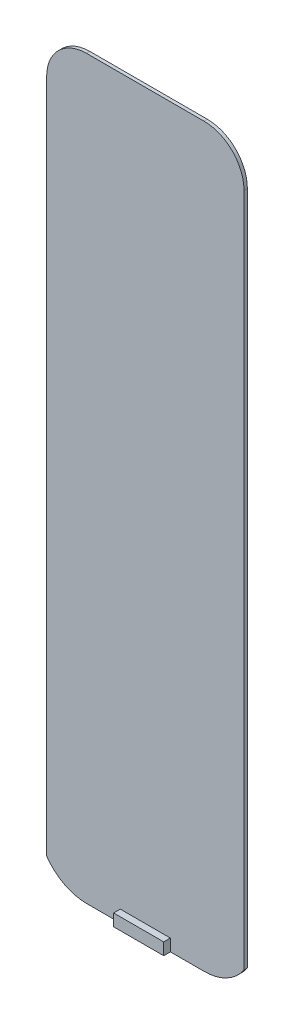
ISO-10303-21;
HEADER;
FILE_DESCRIPTION(('STEP AP214'),'2;1');
FILE_NAME('part.step','',(''),(''),'','','');
FILE_SCHEMA(('AUTOMOTIVE_DESIGN { 1 0 10303 214 1 1 1 1 }'));
ENDSEC;
DATA;
#1=APPLICATION_CONTEXT('core data for automotive mechanical design processes');
#2=APPLICATION_PROTOCOL_DEFINITION('international standard','automotive_design',2000,#1);
#3=PRODUCT_CONTEXT('',#1,'mechanical');
#4=PRODUCT('Part','Part','',(#3));
#5=PRODUCT_RELATED_PRODUCT_CATEGORY('part','',(#4));
#6=PRODUCT_DEFINITION_FORMATION('','',#4);
#7=PRODUCT_DEFINITION_CONTEXT('part definition',#1,'design');
#8=PRODUCT_DEFINITION('design','',#6,#7);
#9=PRODUCT_DEFINITION_SHAPE('','',#8);
#10=(LENGTH_UNIT() NAMED_UNIT(*) SI_UNIT(.MILLI.,.METRE.));
#11=(NAMED_UNIT(*) PLANE_ANGLE_UNIT() SI_UNIT($,.RADIAN.));
#12=(NAMED_UNIT(*) SI_UNIT($,.STERADIAN.) SOLID_ANGLE_UNIT());
#13=UNCERTAINTY_MEASURE_WITH_UNIT(LENGTH_MEASURE(1.E-05),#10,'distance_accuracy_value','');
#14=(GEOMETRIC_REPRESENTATION_CONTEXT(3) GLOBAL_UNCERTAINTY_ASSIGNED_CONTEXT((#13)) GLOBAL_UNIT_ASSIGNED_CONTEXT((#10,
#11,#12)) REPRESENTATION_CONTEXT('',''));
#15=CARTESIAN_POINT('',(0.,0.,0.));
#16=DIRECTION('',(0.,0.,1.));
#17=DIRECTION('',(1.,0.,0.));
#18=AXIS2_PLACEMENT_3D('',#15,#16,#17);
#19=CARTESIAN_POINT('',(-17.5243575181583,-95.5,0.5));
#20=DIRECTION('',(0.,0.,-1.));
#21=DIRECTION('',(-1.,0.,0.));
#22=AXIS2_PLACEMENT_3D('',#19,#20,#21);
#23=PLANE('',#22);
#24=DIRECTION('',(0.,-1.,0.));
#25=VECTOR('',#24,1.);
#26=CARTESIAN_POINT('',(-7.49999999999996,-106.5,0.5));
#27=LINE('',#26,#25);
#28=CARTESIAN_POINT('',(-7.49999999999996,-106.5,0.5));
#29=VERTEX_POINT('',#28);
#30=CARTESIAN_POINT('',(-7.49999999999996,-110.1,0.5));
#31=VERTEX_POINT('',#30);
#32=EDGE_CURVE('E202',#29,#31,#27,.T.);
#33=ORIENTED_EDGE('',*,*,#32,.F.);
#34=DIRECTION('',(1.,0.,0.));
#35=VECTOR('',#34,1.);
#36=CARTESIAN_POINT('',(-7.49999999999996,-106.5,0.5));
#37=LINE('',#36,#35);
#38=CARTESIAN_POINT('',(7.50000000000004,-106.5,0.5));
#39=VERTEX_POINT('',#38);
#40=EDGE_CURVE('E189',#29,#39,#37,.T.);
#41=ORIENTED_EDGE('',*,*,#40,.T.);
#42=DIRECTION('',(0.,-1.,0.));
#43=VECTOR('',#42,1.);
#44=CARTESIAN_POINT('',(7.50000000000004,-106.5,0.5));
#45=LINE('',#44,#43);
#46=CARTESIAN_POINT('',(7.50000000000004,-110.1,0.5));
#47=VERTEX_POINT('',#46);
#48=EDGE_CURVE('E199',#39,#47,#45,.T.);
#49=ORIENTED_EDGE('',*,*,#48,.T.);
#50=DIRECTION('',(1.,0.,0.));
#51=VECTOR('',#50,1.);
#52=CARTESIAN_POINT('',(17.6756424818417,-110.1,0.5));
#53=LINE('',#52,#51);
#54=CARTESIAN_POINT('',(17.6756424818417,-110.1,0.5));
#55=VERTEX_POINT('',#54);
#56=EDGE_CURVE('E210',#47,#55,#53,.T.);
#57=ORIENTED_EDGE('',*,*,#56,.T.);
#58=CARTESIAN_POINT('',(17.6756424818417,-95.7855956890526,0.5));
#59=DIRECTION('',(0.,0.,1.));
#60=DIRECTION('',(-1.,0.,0.));
#61=AXIS2_PLACEMENT_3D('',#58,#59,#60);
#62=CIRCLE('',#61,14.3144043109474);
#63=CARTESIAN_POINT('',(29.56,-103.764581662086,0.5));
#64=VERTEX_POINT('',#63);
#65=EDGE_CURVE('E215',#55,#64,#62,.T.);
#66=ORIENTED_EDGE('',*,*,#65,.T.);
#67=DIRECTION('',(0.,1.,0.));
#68=VECTOR('',#67,1.);
#69=CARTESIAN_POINT('',(29.56,98.5,0.5));
#70=LINE('',#69,#68);
#71=CARTESIAN_POINT('',(29.56,98.5,0.5));
#72=VERTEX_POINT('',#71);
#73=EDGE_CURVE('E217',#64,#72,#70,.T.);
#74=ORIENTED_EDGE('',*,*,#73,.T.);
#75=CARTESIAN_POINT('',(17.6,98.5,0.5));
#76=DIRECTION('',(0.,0.,1.));
#77=DIRECTION('',(-1.,0.,0.));
#78=AXIS2_PLACEMENT_3D('',#75,#76,#77);
#79=CIRCLE('',#78,11.96);
#80=CARTESIAN_POINT('',(17.6,110.46,0.5));
#81=VERTEX_POINT('',#80);
#82=EDGE_CURVE('E219',#72,#81,#79,.T.);
#83=ORIENTED_EDGE('',*,*,#82,.T.);
#84=DIRECTION('',(-1.,0.,0.));
#85=VECTOR('',#84,1.);
#86=CARTESIAN_POINT('',(-17.6,110.46,0.5));
#87=LINE('',#86,#85);
#88=CARTESIAN_POINT('',(-17.6,110.46,0.5));
#89=VERTEX_POINT('',#88);
#90=EDGE_CURVE('E221',#81,#89,#87,.T.);
#91=ORIENTED_EDGE('',*,*,#90,.T.);
#92=CARTESIAN_POINT('',(-17.6,98.5,0.5));
#93=DIRECTION('',(0.,0.,1.));
#94=DIRECTION('',(1.,0.,0.));
#95=AXIS2_PLACEMENT_3D('',#92,#93,#94);
#96=CIRCLE('',#95,11.9599999999999);
#97=CARTESIAN_POINT('',(-29.56,98.5,0.5));
#98=VERTEX_POINT('',#97);
#99=EDGE_CURVE('E223',#89,#98,#96,.T.);
#100=ORIENTED_EDGE('',*,*,#99,.T.);
#101=DIRECTION('',(0.,-1.,0.));
#102=VECTOR('',#101,1.);
#103=CARTESIAN_POINT('',(-29.5599999999999,98.5,0.5));
#104=LINE('',#103,#102);
#105=CARTESIAN_POINT('',(-29.5599999999999,-103.764581662086,0.5));
#106=VERTEX_POINT('',#105);
#107=EDGE_CURVE('E225',#98,#106,#104,.T.);
#108=ORIENTED_EDGE('',*,*,#107,.T.);
#109=CARTESIAN_POINT('',(-17.5243575181583,-95.5,0.5));
#110=DIRECTION('',(0.,0.,1.));
#111=DIRECTION('',(-1.,0.,0.));
#112=AXIS2_PLACEMENT_3D('',#109,#110,#111);
#113=CIRCLE('',#112,14.6);
#114=CARTESIAN_POINT('',(-17.5243575181583,-110.1,0.5));
#115=VERTEX_POINT('',#114);
#116=EDGE_CURVE('E207',#106,#115,#113,.T.);
#117=ORIENTED_EDGE('',*,*,#116,.T.);
#118=EDGE_CURVE('E212',#115,#31,#53,.T.);
#119=ORIENTED_EDGE('',*,*,#118,.T.);
#120=EDGE_LOOP('',(#33,#41,#49,#57,#66,#74,#83,#91,#100,#108,#117,#119));
#121=FACE_BOUND('',#120,.T.);
#122=ADVANCED_FACE('F33',(#121),#23,.F.);
#123=CARTESIAN_POINT('',(-17.5243575181583,-95.5,0.5));
#124=DIRECTION('',(0.,0.,-1.));
#125=DIRECTION('',(-1.,0.,0.));
#126=AXIS2_PLACEMENT_3D('',#123,#124,#125);
#127=CYLINDRICAL_SURFACE('',#126,14.6);
#128=CARTESIAN_POINT('',(-17.5243575181583,-95.5,-0.5));
#129=DIRECTION('',(0.,0.,1.));
#130=DIRECTION('',(-1.,0.,0.));
#131=AXIS2_PLACEMENT_3D('',#128,#129,#130);
#132=CIRCLE('',#131,14.6);
#133=CARTESIAN_POINT('',(-29.5599999999999,-103.764581662086,-0.5));
#134=VERTEX_POINT('',#133);
#135=CARTESIAN_POINT('',(-17.5243575181583,-110.1,-0.5));
#136=VERTEX_POINT('',#135);
#137=EDGE_CURVE('E201',#134,#136,#132,.T.);
#138=ORIENTED_EDGE('',*,*,#137,.T.);
#139=DIRECTION('',(0.,0.,-1.));
#140=VECTOR('',#139,1.);
#141=CARTESIAN_POINT('',(-17.5243575181583,-110.1,0.5));
#142=LINE('',#141,#140);
#143=EDGE_CURVE('E11',#115,#136,#142,.T.);
#144=ORIENTED_EDGE('',*,*,#143,.F.);
#145=ORIENTED_EDGE('',*,*,#116,.F.);
#146=DIRECTION('',(0.,0.,-1.));
#147=VECTOR('',#146,1.);
#148=CARTESIAN_POINT('',(-29.5599999999999,-103.764581662086,0.5));
#149=LINE('',#148,#147);
#150=EDGE_CURVE('E227',#106,#134,#149,.T.);
#151=ORIENTED_EDGE('',*,*,#150,.T.);
#152=EDGE_LOOP('',(#138,#144,#145,#151));
#153=FACE_BOUND('',#152,.T.);
#154=ADVANCED_FACE('F35',(#153),#127,.T.);
#155=CARTESIAN_POINT('',(17.6756424818417,-110.1,0.5));
#156=DIRECTION('',(0.,1.,0.));
#157=DIRECTION('',(-1.,0.,0.));
#158=AXIS2_PLACEMENT_3D('',#155,#156,#157);
#159=PLANE('',#158);
#160=DIRECTION('',(1.,0.,0.));
#161=VECTOR('',#160,1.);
#162=CARTESIAN_POINT('',(17.6756424818417,-110.1,-0.5));
#163=LINE('',#162,#161);
#164=CARTESIAN_POINT('',(-7.49999999999996,-110.1,-0.5));
#165=VERTEX_POINT('',#164);
#166=EDGE_CURVE('E231',#136,#165,#163,.T.);
#167=ORIENTED_EDGE('',*,*,#166,.T.);
#168=DIRECTION('',(0.,0.,-1.));
#169=VECTOR('',#168,1.);
#170=CARTESIAN_POINT('',(-7.49999999999996,-110.1,-2.5));
#171=LINE('',#170,#169);
#172=CARTESIAN_POINT('',(-7.49999999999996,-110.1,-2.5));
#173=VERTEX_POINT('',#172);
#174=EDGE_CURVE('E48',#165,#173,#171,.T.);
#175=ORIENTED_EDGE('',*,*,#174,.T.);
#176=DIRECTION('',(1.,0.,0.));
#177=VECTOR('',#176,1.);
#178=CARTESIAN_POINT('',(-7.49999999999996,-110.1,-2.5));
#179=LINE('',#178,#177);
#180=CARTESIAN_POINT('',(7.50000000000004,-110.1,-2.5));
#181=VERTEX_POINT('',#180);
#182=EDGE_CURVE('E151',#173,#181,#179,.T.);
#183=ORIENTED_EDGE('',*,*,#182,.T.);
#184=DIRECTION('',(0.,0.,1.));
#185=VECTOR('',#184,1.);
#186=CARTESIAN_POINT('',(7.50000000000004,-110.1,-2.5));
#187=LINE('',#186,#185);
#188=CARTESIAN_POINT('',(7.50000000000004,-110.1,-0.5));
#189=VERTEX_POINT('',#188);
#190=EDGE_CURVE('E167',#181,#189,#187,.T.);
#191=ORIENTED_EDGE('',*,*,#190,.T.);
#192=CARTESIAN_POINT('',(17.6756424818417,-110.1,-0.5));
#193=VERTEX_POINT('',#192);
#194=EDGE_CURVE('E230',#189,#193,#163,.T.);
#195=ORIENTED_EDGE('',*,*,#194,.T.);
#196=DIRECTION('',(0.,0.,-1.));
#197=VECTOR('',#196,1.);
#198=CARTESIAN_POINT('',(17.6756424818417,-110.1,0.5));
#199=LINE('',#198,#197);
#200=EDGE_CURVE('E41',#55,#193,#199,.T.);
#201=ORIENTED_EDGE('',*,*,#200,.F.);
#202=ORIENTED_EDGE('',*,*,#56,.F.);
#203=DIRECTION('',(0.,0.,1.));
#204=VECTOR('',#203,1.);
#205=CARTESIAN_POINT('',(7.50000000000004,-110.1,0.5));
#206=LINE('',#205,#204);
#207=CARTESIAN_POINT('',(7.50000000000004,-110.1,2.5));
#208=VERTEX_POINT('',#207);
#209=EDGE_CURVE('E56',#47,#208,#206,.T.);
#210=ORIENTED_EDGE('',*,*,#209,.T.);
#211=DIRECTION('',(-1.,0.,0.));
#212=VECTOR('',#211,1.);
#213=CARTESIAN_POINT('',(-7.49999999999996,-110.1,2.5));
#214=LINE('',#213,#212);
#215=CARTESIAN_POINT('',(-7.49999999999996,-110.1,2.5));
#216=VERTEX_POINT('',#215);
#217=EDGE_CURVE('E194',#208,#216,#214,.T.);
#218=ORIENTED_EDGE('',*,*,#217,.T.);
#219=DIRECTION('',(0.,0.,-1.));
#220=VECTOR('',#219,1.);
#221=CARTESIAN_POINT('',(-7.49999999999996,-110.1,0.5));
#222=LINE('',#221,#220);
#223=EDGE_CURVE('E184',#216,#31,#222,.T.);
#224=ORIENTED_EDGE('',*,*,#223,.T.);
#225=ORIENTED_EDGE('',*,*,#118,.F.);
#226=ORIENTED_EDGE('',*,*,#143,.T.);
#227=EDGE_LOOP('',(#167,#175,#183,#191,#195,#201,#202,#210,#218,#224,#225,#226));
#228=FACE_BOUND('',#227,.T.);
#229=ADVANCED_FACE('F289',(#228),#159,.F.);
#230=CARTESIAN_POINT('',(17.6756424818417,-95.7855956890526,0.5));
#231=DIRECTION('',(0.,0.,-1.));
#232=DIRECTION('',(-1.,0.,0.));
#233=AXIS2_PLACEMENT_3D('',#230,#231,#232);
#234=CYLINDRICAL_SURFACE('',#233,14.3144043109474);
#235=CARTESIAN_POINT('',(17.6756424818417,-95.7855956890526,-0.5));
#236=DIRECTION('',(0.,0.,1.));
#237=DIRECTION('',(-1.,0.,0.));
#238=AXIS2_PLACEMENT_3D('',#235,#236,#237);
#239=CIRCLE('',#238,14.3144043109474);
#240=CARTESIAN_POINT('',(29.56,-103.764581662086,-0.5));
#241=VERTEX_POINT('',#240);
#242=EDGE_CURVE('E234',#193,#241,#239,.T.);
#243=ORIENTED_EDGE('',*,*,#242,.T.);
#244=DIRECTION('',(0.,0.,-1.));
#245=VECTOR('',#244,1.);
#246=CARTESIAN_POINT('',(29.56,-103.764581662086,0.5));
#247=LINE('',#246,#245);
#248=EDGE_CURVE('E259',#64,#241,#247,.T.);
#249=ORIENTED_EDGE('',*,*,#248,.F.);
#250=ORIENTED_EDGE('',*,*,#65,.F.);
#251=ORIENTED_EDGE('',*,*,#200,.T.);
#252=EDGE_LOOP('',(#243,#249,#250,#251));
#253=FACE_BOUND('',#252,.T.);
#254=ADVANCED_FACE('F266',(#253),#234,.T.);
#255=CARTESIAN_POINT('',(29.56,98.5,0.5));
#256=DIRECTION('',(-1.,0.,0.));
#257=DIRECTION('',(0.,-1.,0.));
#258=AXIS2_PLACEMENT_3D('',#255,#256,#257);
#259=PLANE('',#258);
#260=DIRECTION('',(0.,1.,0.));
#261=VECTOR('',#260,1.);
#262=CARTESIAN_POINT('',(29.56,98.5,-0.5));
#263=LINE('',#262,#261);
#264=CARTESIAN_POINT('',(29.56,98.5,-0.5));
#265=VERTEX_POINT('',#264);
#266=EDGE_CURVE('E236',#241,#265,#263,.T.);
#267=ORIENTED_EDGE('',*,*,#266,.T.);
#268=DIRECTION('',(0.,0.,-1.));
#269=VECTOR('',#268,1.);
#270=CARTESIAN_POINT('',(29.56,98.5,0.5));
#271=LINE('',#270,#269);
#272=EDGE_CURVE('E256',#72,#265,#271,.T.);
#273=ORIENTED_EDGE('',*,*,#272,.F.);
#274=ORIENTED_EDGE('',*,*,#73,.F.);
#275=ORIENTED_EDGE('',*,*,#248,.T.);
#276=EDGE_LOOP('',(#267,#273,#274,#275));
#277=FACE_BOUND('',#276,.T.);
#278=ADVANCED_FACE('F279',(#277),#259,.F.);
#279=CARTESIAN_POINT('',(17.6,98.5,0.5));
#280=DIRECTION('',(0.,0.,-1.));
#281=DIRECTION('',(-1.,0.,0.));
#282=AXIS2_PLACEMENT_3D('',#279,#280,#281);
#283=CYLINDRICAL_SURFACE('',#282,11.96);
#284=CARTESIAN_POINT('',(17.6,98.5,-0.5));
#285=DIRECTION('',(0.,0.,1.));
#286=DIRECTION('',(-1.,0.,0.));
#287=AXIS2_PLACEMENT_3D('',#284,#285,#286);
#288=CIRCLE('',#287,11.96);
#289=CARTESIAN_POINT('',(17.6,110.46,-0.5));
#290=VERTEX_POINT('',#289);
#291=EDGE_CURVE('E238',#265,#290,#288,.T.);
#292=ORIENTED_EDGE('',*,*,#291,.T.);
#293=DIRECTION('',(0.,0.,-1.));
#294=VECTOR('',#293,1.);
#295=CARTESIAN_POINT('',(17.6,110.46,0.5));
#296=LINE('',#295,#294);
#297=EDGE_CURVE('E253',#81,#290,#296,.T.);
#298=ORIENTED_EDGE('',*,*,#297,.F.);
#299=ORIENTED_EDGE('',*,*,#82,.F.);
#300=ORIENTED_EDGE('',*,*,#272,.T.);
#301=EDGE_LOOP('',(#292,#298,#299,#300));
#302=FACE_BOUND('',#301,.T.);
#303=ADVANCED_FACE('F283',(#302),#283,.T.);
#304=CARTESIAN_POINT('',(-17.6,110.46,0.5));
#305=DIRECTION('',(0.,-1.,0.));
#306=DIRECTION('',(0.,0.,-1.));
#307=AXIS2_PLACEMENT_3D('',#304,#305,#306);
#308=PLANE('',#307);
#309=DIRECTION('',(-1.,0.,0.));
#310=VECTOR('',#309,1.);
#311=CARTESIAN_POINT('',(-17.6,110.46,-0.5));
#312=LINE('',#311,#310);
#313=CARTESIAN_POINT('',(-17.6,110.46,-0.5));
#314=VERTEX_POINT('',#313);
#315=EDGE_CURVE('E240',#290,#314,#312,.T.);
#316=ORIENTED_EDGE('',*,*,#315,.T.);
#317=DIRECTION('',(0.,0.,-1.));
#318=VECTOR('',#317,1.);
#319=CARTESIAN_POINT('',(-17.6,110.46,0.5));
#320=LINE('',#319,#318);
#321=EDGE_CURVE('E250',#89,#314,#320,.T.);
#322=ORIENTED_EDGE('',*,*,#321,.F.);
#323=ORIENTED_EDGE('',*,*,#90,.F.);
#324=ORIENTED_EDGE('',*,*,#297,.T.);
#325=EDGE_LOOP('',(#316,#322,#323,#324));
#326=FACE_BOUND('',#325,.T.);
#327=ADVANCED_FACE('F339',(#326),#308,.F.);
#328=CARTESIAN_POINT('',(-17.6,98.5,0.5));
#329=DIRECTION('',(0.,0.,-1.));
#330=DIRECTION('',(-1.,0.,0.));
#331=AXIS2_PLACEMENT_3D('',#328,#329,#330);
#332=CYLINDRICAL_SURFACE('',#331,11.9599999999999);
#333=CARTESIAN_POINT('',(-17.6,98.5,-0.5));
#334=DIRECTION('',(0.,0.,1.));
#335=DIRECTION('',(1.,0.,0.));
#336=AXIS2_PLACEMENT_3D('',#333,#334,#335);
#337=CIRCLE('',#336,11.9599999999999);
#338=CARTESIAN_POINT('',(-29.56,98.5,-0.5));
#339=VERTEX_POINT('',#338);
#340=EDGE_CURVE('E242',#314,#339,#337,.T.);
#341=ORIENTED_EDGE('',*,*,#340,.T.);
#342=DIRECTION('',(0.,0.,-1.));
#343=VECTOR('',#342,1.);
#344=CARTESIAN_POINT('',(-29.56,98.5,0.5));
#345=LINE('',#344,#343);
#346=EDGE_CURVE('E247',#98,#339,#345,.T.);
#347=ORIENTED_EDGE('',*,*,#346,.F.);
#348=ORIENTED_EDGE('',*,*,#99,.F.);
#349=ORIENTED_EDGE('',*,*,#321,.T.);
#350=EDGE_LOOP('',(#341,#347,#348,#349));
#351=FACE_BOUND('',#350,.T.);
#352=ADVANCED_FACE('F335',(#351),#332,.T.);
#353=CARTESIAN_POINT('',(-29.5599999999999,98.5,0.5));
#354=DIRECTION('',(1.,0.,0.));
#355=DIRECTION('',(0.,1.,0.));
#356=AXIS2_PLACEMENT_3D('',#353,#354,#355);
#357=PLANE('',#356);
#358=DIRECTION('',(0.,-1.,0.));
#359=VECTOR('',#358,1.);
#360=CARTESIAN_POINT('',(-29.5599999999999,98.5,-0.5));
#361=LINE('',#360,#359);
#362=EDGE_CURVE('E211',#339,#134,#361,.T.);
#363=ORIENTED_EDGE('',*,*,#362,.T.);
#364=ORIENTED_EDGE('',*,*,#150,.F.);
#365=ORIENTED_EDGE('',*,*,#107,.F.);
#366=ORIENTED_EDGE('',*,*,#346,.T.);
#367=EDGE_LOOP('',(#363,#364,#365,#366));
#368=FACE_BOUND('',#367,.T.);
#369=ADVANCED_FACE('F332',(#368),#357,.F.);
#370=CARTESIAN_POINT('',(-17.5243575181583,-95.5,-0.5));
#371=DIRECTION('',(0.,0.,-1.));
#372=DIRECTION('',(-1.,0.,0.));
#373=AXIS2_PLACEMENT_3D('',#370,#371,#372);
#374=PLANE('',#373);
#375=DIRECTION('',(0.,-1.,0.));
#376=VECTOR('',#375,1.);
#377=CARTESIAN_POINT('',(7.50000000000004,-106.5,-0.5));
#378=LINE('',#377,#376);
#379=CARTESIAN_POINT('',(7.50000000000004,-106.5,-0.5));
#380=VERTEX_POINT('',#379);
#381=EDGE_CURVE('E177',#380,#189,#378,.T.);
#382=ORIENTED_EDGE('',*,*,#381,.F.);
#383=DIRECTION('',(-1.,0.,0.));
#384=VECTOR('',#383,1.);
#385=CARTESIAN_POINT('',(7.50000000000004,-106.5,-0.5));
#386=LINE('',#385,#384);
#387=CARTESIAN_POINT('',(-7.49999999999996,-106.5,-0.5));
#388=VERTEX_POINT('',#387);
#389=EDGE_CURVE('E154',#380,#388,#386,.T.);
#390=ORIENTED_EDGE('',*,*,#389,.T.);
#391=DIRECTION('',(0.,-1.,0.));
#392=VECTOR('',#391,1.);
#393=CARTESIAN_POINT('',(-7.49999999999996,-106.5,-0.5));
#394=LINE('',#393,#392);
#395=EDGE_CURVE('E166',#388,#165,#394,.T.);
#396=ORIENTED_EDGE('',*,*,#395,.T.);
#397=ORIENTED_EDGE('',*,*,#166,.F.);
#398=ORIENTED_EDGE('',*,*,#137,.F.);
#399=ORIENTED_EDGE('',*,*,#362,.F.);
#400=ORIENTED_EDGE('',*,*,#340,.F.);
#401=ORIENTED_EDGE('',*,*,#315,.F.);
#402=ORIENTED_EDGE('',*,*,#291,.F.);
#403=ORIENTED_EDGE('',*,*,#266,.F.);
#404=ORIENTED_EDGE('',*,*,#242,.F.);
#405=ORIENTED_EDGE('',*,*,#194,.F.);
#406=EDGE_LOOP('',(#382,#390,#396,#397,#398,#399,#400,#401,#402,#403,#404,#405));
#407=FACE_BOUND('',#406,.T.);
#408=ADVANCED_FACE('F274',(#407),#374,.T.);
#409=CARTESIAN_POINT('',(7.50000000000004,-106.5,0.5));
#410=DIRECTION('',(1.,0.,0.));
#411=DIRECTION('',(0.,1.,0.));
#412=AXIS2_PLACEMENT_3D('',#409,#410,#411);
#413=PLANE('',#412);
#414=ORIENTED_EDGE('',*,*,#209,.F.);
#415=ORIENTED_EDGE('',*,*,#48,.F.);
#416=DIRECTION('',(0.,0.,1.));
#417=VECTOR('',#416,1.);
#418=CARTESIAN_POINT('',(7.50000000000004,-106.5,0.5));
#419=LINE('',#418,#417);
#420=CARTESIAN_POINT('',(7.50000000000004,-106.5,2.5));
#421=VERTEX_POINT('',#420);
#422=EDGE_CURVE('E180',#39,#421,#419,.T.);
#423=ORIENTED_EDGE('',*,*,#422,.T.);
#424=DIRECTION('',(0.,-1.,0.));
#425=VECTOR('',#424,1.);
#426=CARTESIAN_POINT('',(7.50000000000004,-106.5,2.5));
#427=LINE('',#426,#425);
#428=EDGE_CURVE('E192',#421,#208,#427,.T.);
#429=ORIENTED_EDGE('',*,*,#428,.T.);
#430=EDGE_LOOP('',(#414,#415,#423,#429));
#431=FACE_BOUND('',#430,.T.);
#432=ADVANCED_FACE('F328',(#431),#413,.T.);
#433=CARTESIAN_POINT('',(-7.49999999999996,-106.5,0.5));
#434=DIRECTION('',(-1.,0.,0.));
#435=DIRECTION('',(0.,0.,1.));
#436=AXIS2_PLACEMENT_3D('',#433,#434,#435);
#437=PLANE('',#436);
#438=ORIENTED_EDGE('',*,*,#223,.F.);
#439=DIRECTION('',(0.,-1.,0.));
#440=VECTOR('',#439,1.);
#441=CARTESIAN_POINT('',(-7.49999999999996,-106.5,2.5));
#442=LINE('',#441,#440);
#443=CARTESIAN_POINT('',(-7.49999999999996,-106.5,2.5));
#444=VERTEX_POINT('',#443);
#445=EDGE_CURVE('E204',#444,#216,#442,.T.);
#446=ORIENTED_EDGE('',*,*,#445,.F.);
#447=DIRECTION('',(0.,0.,-1.));
#448=VECTOR('',#447,1.);
#449=CARTESIAN_POINT('',(-7.49999999999996,-106.5,0.5));
#450=LINE('',#449,#448);
#451=EDGE_CURVE('E187',#444,#29,#450,.T.);
#452=ORIENTED_EDGE('',*,*,#451,.T.);
#453=ORIENTED_EDGE('',*,*,#32,.T.);
#454=EDGE_LOOP('',(#438,#446,#452,#453));
#455=FACE_BOUND('',#454,.T.);
#456=ADVANCED_FACE('F297',(#455),#437,.T.);
#457=CARTESIAN_POINT('',(-7.49999999999996,-106.5,2.5));
#458=DIRECTION('',(0.,0.,1.));
#459=DIRECTION('',(1.,0.,0.));
#460=AXIS2_PLACEMENT_3D('',#457,#458,#459);
#461=PLANE('',#460);
#462=ORIENTED_EDGE('',*,*,#217,.F.);
#463=ORIENTED_EDGE('',*,*,#428,.F.);
#464=DIRECTION('',(-1.,0.,0.));
#465=VECTOR('',#464,1.);
#466=CARTESIAN_POINT('',(-7.49999999999996,-106.5,2.5));
#467=LINE('',#466,#465);
#468=EDGE_CURVE('E183',#421,#444,#467,.T.);
#469=ORIENTED_EDGE('',*,*,#468,.T.);
#470=ORIENTED_EDGE('',*,*,#445,.T.);
#471=EDGE_LOOP('',(#462,#463,#469,#470));
#472=FACE_BOUND('',#471,.T.);
#473=ADVANCED_FACE('F293',(#472),#461,.T.);
#474=CARTESIAN_POINT('',(0.,-106.5,0.));
#475=DIRECTION('',(0.,1.,0.));
#476=DIRECTION('',(0.,0.,1.));
#477=AXIS2_PLACEMENT_3D('',#474,#475,#476);
#478=PLANE('',#477);
#479=ORIENTED_EDGE('',*,*,#422,.F.);
#480=ORIENTED_EDGE('',*,*,#40,.F.);
#481=ORIENTED_EDGE('',*,*,#451,.F.);
#482=ORIENTED_EDGE('',*,*,#468,.F.);
#483=EDGE_LOOP('',(#479,#480,#481,#482));
#484=FACE_BOUND('',#483,.T.);
#485=ADVANCED_FACE('F316',(#484),#478,.T.);
#486=CARTESIAN_POINT('',(-7.49999999999996,-106.5,-2.5));
#487=DIRECTION('',(-1.,0.,0.));
#488=DIRECTION('',(0.,0.,1.));
#489=AXIS2_PLACEMENT_3D('',#486,#487,#488);
#490=PLANE('',#489);
#491=ORIENTED_EDGE('',*,*,#174,.F.);
#492=ORIENTED_EDGE('',*,*,#395,.F.);
#493=DIRECTION('',(0.,0.,-1.));
#494=VECTOR('',#493,1.);
#495=CARTESIAN_POINT('',(-7.49999999999996,-106.5,-2.5));
#496=LINE('',#495,#494);
#497=CARTESIAN_POINT('',(-7.49999999999996,-106.5,-2.5));
#498=VERTEX_POINT('',#497);
#499=EDGE_CURVE('E161',#388,#498,#496,.T.);
#500=ORIENTED_EDGE('',*,*,#499,.T.);
#501=DIRECTION('',(0.,-1.,0.));
#502=VECTOR('',#501,1.);
#503=CARTESIAN_POINT('',(-7.49999999999996,-106.5,-2.5));
#504=LINE('',#503,#502);
#505=EDGE_CURVE('E146',#498,#173,#504,.T.);
#506=ORIENTED_EDGE('',*,*,#505,.T.);
#507=EDGE_LOOP('',(#491,#492,#500,#506));
#508=FACE_BOUND('',#507,.T.);
#509=ADVANCED_FACE('F165',(#508),#490,.T.);
#510=CARTESIAN_POINT('',(7.50000000000004,-106.5,-2.5));
#511=DIRECTION('',(1.,0.,0.));
#512=DIRECTION('',(0.,0.,-1.));
#513=AXIS2_PLACEMENT_3D('',#510,#511,#512);
#514=PLANE('',#513);
#515=ORIENTED_EDGE('',*,*,#190,.F.);
#516=DIRECTION('',(0.,-1.,0.));
#517=VECTOR('',#516,1.);
#518=CARTESIAN_POINT('',(7.50000000000004,-106.5,-2.5));
#519=LINE('',#518,#517);
#520=CARTESIAN_POINT('',(7.50000000000004,-106.5,-2.5));
#521=VERTEX_POINT('',#520);
#522=EDGE_CURVE('E153',#521,#181,#519,.T.);
#523=ORIENTED_EDGE('',*,*,#522,.F.);
#524=DIRECTION('',(0.,0.,1.));
#525=VECTOR('',#524,1.);
#526=CARTESIAN_POINT('',(7.50000000000004,-106.5,-2.5));
#527=LINE('',#526,#525);
#528=EDGE_CURVE('E163',#521,#380,#527,.T.);
#529=ORIENTED_EDGE('',*,*,#528,.T.);
#530=ORIENTED_EDGE('',*,*,#381,.T.);
#531=EDGE_LOOP('',(#515,#523,#529,#530));
#532=FACE_BOUND('',#531,.T.);
#533=ADVANCED_FACE('F308',(#532),#514,.T.);
#534=CARTESIAN_POINT('',(-7.49999999999996,-106.5,-2.5));
#535=DIRECTION('',(0.,0.,-1.));
#536=DIRECTION('',(-1.,0.,0.));
#537=AXIS2_PLACEMENT_3D('',#534,#535,#536);
#538=PLANE('',#537);
#539=ORIENTED_EDGE('',*,*,#182,.F.);
#540=ORIENTED_EDGE('',*,*,#505,.F.);
#541=DIRECTION('',(1.,0.,0.));
#542=VECTOR('',#541,1.);
#543=CARTESIAN_POINT('',(-7.49999999999996,-106.5,-2.5));
#544=LINE('',#543,#542);
#545=EDGE_CURVE('E149',#498,#521,#544,.T.);
#546=ORIENTED_EDGE('',*,*,#545,.T.);
#547=ORIENTED_EDGE('',*,*,#522,.T.);
#548=EDGE_LOOP('',(#539,#540,#546,#547));
#549=FACE_BOUND('',#548,.T.);
#550=ADVANCED_FACE('F148',(#549),#538,.T.);
#551=CARTESIAN_POINT('',(0.,-106.5,0.));
#552=DIRECTION('',(0.,-1.,0.));
#553=DIRECTION('',(0.,0.,-1.));
#554=AXIS2_PLACEMENT_3D('',#551,#552,#553);
#555=PLANE('',#554);
#556=ORIENTED_EDGE('',*,*,#499,.F.);
#557=ORIENTED_EDGE('',*,*,#389,.F.);
#558=ORIENTED_EDGE('',*,*,#528,.F.);
#559=ORIENTED_EDGE('',*,*,#545,.F.);
#560=EDGE_LOOP('',(#556,#557,#558,#559));
#561=FACE_BOUND('',#560,.T.);
#562=ADVANCED_FACE('F159',(#561),#555,.F.);
#563=CLOSED_SHELL('',(#122,#154,#229,#254,#278,#303,#327,#352,#369,#408,#432,#456,#473,#485,
#509,#533,#550,#562));
#564=MANIFOLD_SOLID_BREP('B2',#563);
#565=ADVANCED_BREP_SHAPE_REPRESENTATION('',(#18,#564),#14);
#566=SHAPE_DEFINITION_REPRESENTATION(#9,#565);
ENDSEC;
END-ISO-10303-21;
